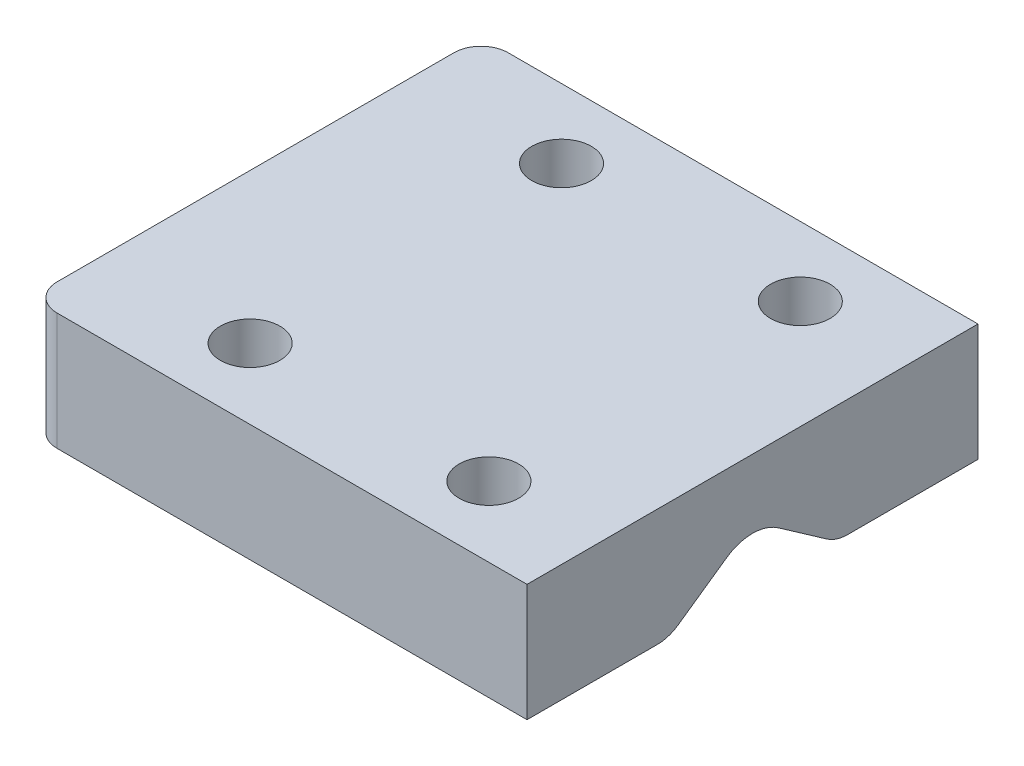
ISO-10303-21;
HEADER;
FILE_DESCRIPTION(('STEP AP214'),'2;1');
FILE_NAME('part.step','',(''),(''),'','','');
FILE_SCHEMA(('AUTOMOTIVE_DESIGN { 1 0 10303 214 1 1 1 1 }'));
ENDSEC;
DATA;
#1=APPLICATION_CONTEXT('core data for automotive mechanical design processes');
#2=APPLICATION_PROTOCOL_DEFINITION('international standard','automotive_design',2000,#1);
#3=PRODUCT_CONTEXT('',#1,'mechanical');
#4=PRODUCT('Part','Part','',(#3));
#5=PRODUCT_RELATED_PRODUCT_CATEGORY('part','',(#4));
#6=PRODUCT_DEFINITION_FORMATION('','',#4);
#7=PRODUCT_DEFINITION_CONTEXT('part definition',#1,'design');
#8=PRODUCT_DEFINITION('design','',#6,#7);
#9=PRODUCT_DEFINITION_SHAPE('','',#8);
#10=(LENGTH_UNIT() NAMED_UNIT(*) SI_UNIT(.MILLI.,.METRE.));
#11=(NAMED_UNIT(*) PLANE_ANGLE_UNIT() SI_UNIT($,.RADIAN.));
#12=(NAMED_UNIT(*) SI_UNIT($,.STERADIAN.) SOLID_ANGLE_UNIT());
#13=UNCERTAINTY_MEASURE_WITH_UNIT(LENGTH_MEASURE(1.E-05),#10,'distance_accuracy_value','');
#14=(GEOMETRIC_REPRESENTATION_CONTEXT(3) GLOBAL_UNCERTAINTY_ASSIGNED_CONTEXT((#13)) GLOBAL_UNIT_ASSIGNED_CONTEXT((#10,
#11,#12)) REPRESENTATION_CONTEXT('',''));
#15=CARTESIAN_POINT('',(0.,0.,0.));
#16=DIRECTION('',(0.,0.,1.));
#17=DIRECTION('',(1.,0.,0.));
#18=AXIS2_PLACEMENT_3D('',#15,#16,#17);
#19=CARTESIAN_POINT('',(0.,68.,0.));
#20=DIRECTION('',(0.,-1.,0.));
#21=DIRECTION('',(0.,0.,-1.));
#22=AXIS2_PLACEMENT_3D('',#19,#20,#21);
#23=PLANE('',#22);
#24=CARTESIAN_POINT('',(15.4737437034702,68.,-17.3243369322658));
#25=DIRECTION('',(0.,1.,0.));
#26=DIRECTION('',(0.,0.,1.));
#27=AXIS2_PLACEMENT_3D('',#24,#25,#26);
#28=CIRCLE('',#27,3.3);
#29=CARTESIAN_POINT('',(15.4737437034702,68.,-14.0243369322658));
#30=VERTEX_POINT('',#29);
#31=EDGE_CURVE('E287',#30,#30,#28,.T.);
#32=ORIENTED_EDGE('',*,*,#31,.T.);
#33=EDGE_LOOP('',(#32));
#34=FACE_BOUND('',#33,.T.);
#35=CARTESIAN_POINT('',(-11.,68.,-17.3243369322658));
#36=DIRECTION('',(0.,1.,0.));
#37=DIRECTION('',(0.,0.,1.));
#38=AXIS2_PLACEMENT_3D('',#35,#36,#37);
#39=CIRCLE('',#38,3.3);
#40=CARTESIAN_POINT('',(-11.,68.,-14.0243369322658));
#41=VERTEX_POINT('',#40);
#42=EDGE_CURVE('E288',#41,#41,#39,.T.);
#43=ORIENTED_EDGE('',*,*,#42,.T.);
#44=EDGE_LOOP('',(#43));
#45=FACE_BOUND('',#44,.T.);
#46=DIRECTION('',(0.,0.,-1.));
#47=VECTOR('',#46,1.);
#48=CARTESIAN_POINT('',(27.5,68.,-25.));
#49=LINE('',#48,#47);
#50=CARTESIAN_POINT('',(27.5,68.,-10.5441571993397));
#51=VERTEX_POINT('',#50);
#52=CARTESIAN_POINT('',(27.5,68.,-25.));
#53=VERTEX_POINT('',#52);
#54=EDGE_CURVE('E157',#51,#53,#49,.T.);
#55=ORIENTED_EDGE('',*,*,#54,.F.);
#56=DIRECTION('',(1.,0.,0.));
#57=VECTOR('',#56,1.);
#58=CARTESIAN_POINT('',(-27.5972353458108,68.,-10.5441571993397));
#59=LINE('',#58,#57);
#60=CARTESIAN_POINT('',(-27.5972353458108,68.,-10.5441571993397));
#61=VERTEX_POINT('',#60);
#62=EDGE_CURVE('E217',#51,#61,#59,.F.);
#63=ORIENTED_EDGE('',*,*,#62,.T.);
#64=DIRECTION('',(0.,0.,1.));
#65=VECTOR('',#64,1.);
#66=CARTESIAN_POINT('',(-27.5972353458108,68.,-25.));
#67=LINE('',#66,#65);
#68=CARTESIAN_POINT('',(-27.5972353458108,68.,-22.));
#69=VERTEX_POINT('',#68);
#70=EDGE_CURVE('E246',#69,#61,#67,.T.);
#71=ORIENTED_EDGE('',*,*,#70,.F.);
#72=CARTESIAN_POINT('',(-24.5972353458108,68.,-22.));
#73=DIRECTION('',(0.,-1.,0.));
#74=DIRECTION('',(0.,0.,-1.));
#75=AXIS2_PLACEMENT_3D('',#72,#73,#74);
#76=CIRCLE('',#75,3.);
#77=CARTESIAN_POINT('',(-24.5972353458108,68.,-25.));
#78=VERTEX_POINT('',#77);
#79=EDGE_CURVE('E187',#69,#78,#76,.T.);
#80=ORIENTED_EDGE('',*,*,#79,.T.);
#81=DIRECTION('',(-1.,0.,0.));
#82=VECTOR('',#81,1.);
#83=CARTESIAN_POINT('',(27.5,68.,-25.));
#84=LINE('',#83,#82);
#85=EDGE_CURVE('E237',#53,#78,#84,.T.);
#86=ORIENTED_EDGE('',*,*,#85,.F.);
#87=EDGE_LOOP('',(#55,#63,#71,#80,#86));
#88=FACE_BOUND('',#87,.T.);
#89=ADVANCED_FACE('F39',(#34,#45,#88),#23,.T.);
#90=CARTESIAN_POINT('',(27.5,81.,-25.));
#91=DIRECTION('',(-1.,0.,0.));
#92=DIRECTION('',(0.,0.,1.));
#93=AXIS2_PLACEMENT_3D('',#90,#91,#92);
#94=PLANE('',#93);
#95=DIRECTION('',(0.,0.573576436351044,0.819152044288993));
#96=VECTOR('',#95,1.);
#97=CARTESIAN_POINT('',(27.5,74.5,0.));
#98=LINE('',#97,#96);
#99=CARTESIAN_POINT('',(27.5,68.723391822844,-8.24985145393554));
#100=VERTEX_POINT('',#99);
#101=CARTESIAN_POINT('',(27.5,72.4918872776377,-2.86788218175522));
#102=VERTEX_POINT('',#101);
#103=EDGE_CURVE('E267',#100,#102,#98,.T.);
#104=ORIENTED_EDGE('',*,*,#103,.F.);
#105=CARTESIAN_POINT('',(27.5,72.,-10.5441571993397));
#106=DIRECTION('',(-1.,0.,0.));
#107=DIRECTION('',(0.,0.,1.));
#108=AXIS2_PLACEMENT_3D('',#105,#106,#107);
#109=CIRCLE('',#108,4.);
#110=EDGE_CURVE('E214',#100,#51,#109,.F.);
#111=ORIENTED_EDGE('',*,*,#110,.T.);
#112=ORIENTED_EDGE('',*,*,#54,.T.);
#113=DIRECTION('',(0.,-1.,0.));
#114=VECTOR('',#113,1.);
#115=CARTESIAN_POINT('',(27.5,81.,-25.));
#116=LINE('',#115,#114);
#117=CARTESIAN_POINT('',(27.5,81.,-25.));
#118=VERTEX_POINT('',#117);
#119=EDGE_CURVE('E134',#118,#53,#116,.T.);
#120=ORIENTED_EDGE('',*,*,#119,.F.);
#121=DIRECTION('',(0.,0.,-1.));
#122=VECTOR('',#121,1.);
#123=CARTESIAN_POINT('',(27.5,81.,-25.));
#124=LINE('',#123,#122);
#125=CARTESIAN_POINT('',(27.5,81.,25.));
#126=VERTEX_POINT('',#125);
#127=EDGE_CURVE('E141',#126,#118,#124,.T.);
#128=ORIENTED_EDGE('',*,*,#127,.F.);
#129=DIRECTION('',(0.,-1.,0.));
#130=VECTOR('',#129,1.);
#131=CARTESIAN_POINT('',(27.5,81.,25.));
#132=LINE('',#131,#130);
#133=CARTESIAN_POINT('',(27.5,68.,25.));
#134=VERTEX_POINT('',#133);
#135=EDGE_CURVE('E161',#126,#134,#132,.T.);
#136=ORIENTED_EDGE('',*,*,#135,.T.);
#137=CARTESIAN_POINT('',(27.5,68.,10.5441571993397));
#138=VERTEX_POINT('',#137);
#139=EDGE_CURVE('E232',#134,#138,#49,.T.);
#140=ORIENTED_EDGE('',*,*,#139,.T.);
#141=CARTESIAN_POINT('',(27.5,72.,10.5441571993397));
#142=DIRECTION('',(-1.,0.,0.));
#143=DIRECTION('',(0.,0.,1.));
#144=AXIS2_PLACEMENT_3D('',#141,#142,#143);
#145=CIRCLE('',#144,4.);
#146=CARTESIAN_POINT('',(27.5,68.723391822844,8.24985145393554));
#147=VERTEX_POINT('',#146);
#148=EDGE_CURVE('E211',#138,#147,#145,.F.);
#149=ORIENTED_EDGE('',*,*,#148,.T.);
#150=DIRECTION('',(0.,-0.573576436351044,0.819152044288993));
#151=VECTOR('',#150,1.);
#152=CARTESIAN_POINT('',(27.5,74.5,0.));
#153=LINE('',#152,#151);
#154=CARTESIAN_POINT('',(27.5,72.4918872776377,2.86788218175521));
#155=VERTEX_POINT('',#154);
#156=EDGE_CURVE('E263',#155,#147,#153,.T.);
#157=ORIENTED_EDGE('',*,*,#156,.F.);
#158=CARTESIAN_POINT('',(27.5,68.3961270561927,0.));
#159=DIRECTION('',(-1.,0.,0.));
#160=DIRECTION('',(0.,0.,1.));
#161=AXIS2_PLACEMENT_3D('',#158,#159,#160);
#162=CIRCLE('',#161,5.);
#163=EDGE_CURVE('E200',#155,#102,#162,.T.);
#164=ORIENTED_EDGE('',*,*,#163,.T.);
#165=EDGE_LOOP('',(#104,#111,#112,#120,#128,#136,#140,#149,#157,#164));
#166=FACE_BOUND('',#165,.T.);
#167=ADVANCED_FACE('F155',(#166),#94,.F.);
#168=CARTESIAN_POINT('',(27.5,81.,-25.));
#169=DIRECTION('',(0.,0.,1.));
#170=DIRECTION('',(1.,0.,0.));
#171=AXIS2_PLACEMENT_3D('',#168,#169,#170);
#172=PLANE('',#171);
#173=ORIENTED_EDGE('',*,*,#85,.T.);
#174=DIRECTION('',(0.,-1.,0.));
#175=VECTOR('',#174,1.);
#176=CARTESIAN_POINT('',(-24.5972353458108,81.,-25.));
#177=LINE('',#176,#175);
#178=CARTESIAN_POINT('',(-24.5972353458108,81.,-25.));
#179=VERTEX_POINT('',#178);
#180=EDGE_CURVE('E136',#78,#179,#177,.F.);
#181=ORIENTED_EDGE('',*,*,#180,.T.);
#182=DIRECTION('',(-1.,0.,0.));
#183=VECTOR('',#182,1.);
#184=CARTESIAN_POINT('',(27.5,81.,-25.));
#185=LINE('',#184,#183);
#186=EDGE_CURVE('E129',#118,#179,#185,.T.);
#187=ORIENTED_EDGE('',*,*,#186,.F.);
#188=ORIENTED_EDGE('',*,*,#119,.T.);
#189=EDGE_LOOP('',(#173,#181,#187,#188));
#190=FACE_BOUND('',#189,.T.);
#191=ADVANCED_FACE('F132',(#190),#172,.F.);
#192=CARTESIAN_POINT('',(-27.5972353458108,81.,-25.));
#193=DIRECTION('',(1.,0.,0.));
#194=DIRECTION('',(0.,0.,-1.));
#195=AXIS2_PLACEMENT_3D('',#192,#193,#194);
#196=PLANE('',#195);
#197=ORIENTED_EDGE('',*,*,#70,.T.);
#198=CARTESIAN_POINT('',(-27.5972353458108,72.,-10.5441571993397));
#199=DIRECTION('',(1.,0.,0.));
#200=DIRECTION('',(0.,0.,-1.));
#201=AXIS2_PLACEMENT_3D('',#198,#199,#200);
#202=CIRCLE('',#201,4.);
#203=CARTESIAN_POINT('',(-27.5972353458108,68.723391822844,-8.24985145393553));
#204=VERTEX_POINT('',#203);
#205=EDGE_CURVE('E222',#61,#204,#202,.F.);
#206=ORIENTED_EDGE('',*,*,#205,.T.);
#207=DIRECTION('',(0.,0.573576436351044,0.819152044288993));
#208=VECTOR('',#207,1.);
#209=CARTESIAN_POINT('',(-27.5972353458108,74.5,0.));
#210=LINE('',#209,#208);
#211=CARTESIAN_POINT('',(-27.5972353458108,72.4918872776377,-2.86788218175521));
#212=VERTEX_POINT('',#211);
#213=EDGE_CURVE('E266',#204,#212,#210,.T.);
#214=ORIENTED_EDGE('',*,*,#213,.T.);
#215=CARTESIAN_POINT('',(-27.5972353458108,68.3961270561927,0.));
#216=DIRECTION('',(1.,0.,0.));
#217=DIRECTION('',(0.,0.,-1.));
#218=AXIS2_PLACEMENT_3D('',#215,#216,#217);
#219=CIRCLE('',#218,5.);
#220=CARTESIAN_POINT('',(-27.5972353458108,72.4918872776377,2.86788218175522));
#221=VERTEX_POINT('',#220);
#222=EDGE_CURVE('E204',#212,#221,#219,.T.);
#223=ORIENTED_EDGE('',*,*,#222,.T.);
#224=DIRECTION('',(0.,-0.573576436351044,0.819152044288993));
#225=VECTOR('',#224,1.);
#226=CARTESIAN_POINT('',(-27.5972353458108,74.5,0.));
#227=LINE('',#226,#225);
#228=CARTESIAN_POINT('',(-27.5972353458108,68.723391822844,8.24985145393554));
#229=VERTEX_POINT('',#228);
#230=EDGE_CURVE('E242',#221,#229,#227,.T.);
#231=ORIENTED_EDGE('',*,*,#230,.T.);
#232=CARTESIAN_POINT('',(-27.5972353458108,72.,10.5441571993397));
#233=DIRECTION('',(1.,0.,0.));
#234=DIRECTION('',(0.,0.,-1.));
#235=AXIS2_PLACEMENT_3D('',#232,#233,#234);
#236=CIRCLE('',#235,4.);
#237=CARTESIAN_POINT('',(-27.5972353458108,68.,10.5441571993397));
#238=VERTEX_POINT('',#237);
#239=EDGE_CURVE('E60',#229,#238,#236,.F.);
#240=ORIENTED_EDGE('',*,*,#239,.T.);
#241=CARTESIAN_POINT('',(-27.5972353458108,68.,22.));
#242=VERTEX_POINT('',#241);
#243=EDGE_CURVE('E233',#238,#242,#67,.T.);
#244=ORIENTED_EDGE('',*,*,#243,.T.);
#245=DIRECTION('',(0.,-1.,0.));
#246=VECTOR('',#245,1.);
#247=CARTESIAN_POINT('',(-27.5972353458108,81.,22.));
#248=LINE('',#247,#246);
#249=CARTESIAN_POINT('',(-27.5972353458108,81.,22.));
#250=VERTEX_POINT('',#249);
#251=EDGE_CURVE('E178',#242,#250,#248,.F.);
#252=ORIENTED_EDGE('',*,*,#251,.T.);
#253=DIRECTION('',(0.,0.,1.));
#254=VECTOR('',#253,1.);
#255=CARTESIAN_POINT('',(-27.5972353458108,81.,-25.));
#256=LINE('',#255,#254);
#257=CARTESIAN_POINT('',(-27.5972353458108,81.,-22.));
#258=VERTEX_POINT('',#257);
#259=EDGE_CURVE('E140',#258,#250,#256,.T.);
#260=ORIENTED_EDGE('',*,*,#259,.F.);
#261=DIRECTION('',(0.,-1.,0.));
#262=VECTOR('',#261,1.);
#263=CARTESIAN_POINT('',(-27.5972353458108,81.,-22.));
#264=LINE('',#263,#262);
#265=EDGE_CURVE('E174',#258,#69,#264,.T.);
#266=ORIENTED_EDGE('',*,*,#265,.T.);
#267=EDGE_LOOP('',(#197,#206,#214,#223,#231,#240,#244,#252,#260,#266));
#268=FACE_BOUND('',#267,.T.);
#269=ADVANCED_FACE('F258',(#268),#196,.F.);
#270=CARTESIAN_POINT('',(27.5,81.,25.));
#271=DIRECTION('',(0.,0.,-1.));
#272=DIRECTION('',(-1.,0.,0.));
#273=AXIS2_PLACEMENT_3D('',#270,#271,#272);
#274=PLANE('',#273);
#275=DIRECTION('',(1.,0.,0.));
#276=VECTOR('',#275,1.);
#277=CARTESIAN_POINT('',(27.5,81.,25.));
#278=LINE('',#277,#276);
#279=CARTESIAN_POINT('',(-24.5972353458108,81.,25.));
#280=VERTEX_POINT('',#279);
#281=EDGE_CURVE('E147',#280,#126,#278,.T.);
#282=ORIENTED_EDGE('',*,*,#281,.F.);
#283=DIRECTION('',(0.,-1.,0.));
#284=VECTOR('',#283,1.);
#285=CARTESIAN_POINT('',(-24.5972353458108,81.,25.));
#286=LINE('',#285,#284);
#287=CARTESIAN_POINT('',(-24.5972353458108,68.,25.));
#288=VERTEX_POINT('',#287);
#289=EDGE_CURVE('E160',#280,#288,#286,.T.);
#290=ORIENTED_EDGE('',*,*,#289,.T.);
#291=DIRECTION('',(1.,0.,0.));
#292=VECTOR('',#291,1.);
#293=CARTESIAN_POINT('',(27.5,68.,25.));
#294=LINE('',#293,#292);
#295=EDGE_CURVE('E152',#288,#134,#294,.T.);
#296=ORIENTED_EDGE('',*,*,#295,.T.);
#297=ORIENTED_EDGE('',*,*,#135,.F.);
#298=EDGE_LOOP('',(#282,#290,#296,#297));
#299=FACE_BOUND('',#298,.T.);
#300=ADVANCED_FACE('F251',(#299),#274,.F.);
#301=CARTESIAN_POINT('',(0.,81.,0.));
#302=DIRECTION('',(0.,-1.,0.));
#303=DIRECTION('',(0.,0.,-1.));
#304=AXIS2_PLACEMENT_3D('',#301,#302,#303);
#305=PLANE('',#304);
#306=CARTESIAN_POINT('',(-11.,81.,17.201232434968));
#307=DIRECTION('',(0.,1.,0.));
#308=DIRECTION('',(0.,0.,1.));
#309=AXIS2_PLACEMENT_3D('',#306,#307,#308);
#310=CIRCLE('',#309,3.3);
#311=CARTESIAN_POINT('',(-11.,81.,20.501232434968));
#312=VERTEX_POINT('',#311);
#313=EDGE_CURVE('E292',#312,#312,#310,.T.);
#314=ORIENTED_EDGE('',*,*,#313,.F.);
#315=EDGE_LOOP('',(#314));
#316=FACE_BOUND('',#315,.T.);
#317=CARTESIAN_POINT('',(15.4737437034702,81.,-17.3243369322658));
#318=DIRECTION('',(0.,1.,0.));
#319=DIRECTION('',(0.,0.,1.));
#320=AXIS2_PLACEMENT_3D('',#317,#318,#319);
#321=CIRCLE('',#320,3.3);
#322=CARTESIAN_POINT('',(15.4737437034702,81.,-14.0243369322658));
#323=VERTEX_POINT('',#322);
#324=EDGE_CURVE('E283',#323,#323,#321,.T.);
#325=ORIENTED_EDGE('',*,*,#324,.F.);
#326=EDGE_LOOP('',(#325));
#327=FACE_BOUND('',#326,.T.);
#328=CARTESIAN_POINT('',(-11.,81.,-17.3243369322658));
#329=DIRECTION('',(0.,1.,0.));
#330=DIRECTION('',(0.,0.,1.));
#331=AXIS2_PLACEMENT_3D('',#328,#329,#330);
#332=CIRCLE('',#331,3.3);
#333=CARTESIAN_POINT('',(-11.,81.,-14.0243369322658));
#334=VERTEX_POINT('',#333);
#335=EDGE_CURVE('E299',#334,#334,#332,.T.);
#336=ORIENTED_EDGE('',*,*,#335,.F.);
#337=EDGE_LOOP('',(#336));
#338=FACE_BOUND('',#337,.T.);
#339=CARTESIAN_POINT('',(15.4737437034702,81.,17.2012324349681));
#340=DIRECTION('',(0.,1.,0.));
#341=DIRECTION('',(0.,0.,1.));
#342=AXIS2_PLACEMENT_3D('',#339,#340,#341);
#343=CIRCLE('',#342,3.3);
#344=CARTESIAN_POINT('',(15.4737437034702,81.,20.5012324349681));
#345=VERTEX_POINT('',#344);
#346=EDGE_CURVE('E275',#345,#345,#343,.T.);
#347=ORIENTED_EDGE('',*,*,#346,.F.);
#348=EDGE_LOOP('',(#347));
#349=FACE_BOUND('',#348,.T.);
#350=ORIENTED_EDGE('',*,*,#259,.T.);
#351=CARTESIAN_POINT('',(-24.5972353458108,81.,22.));
#352=DIRECTION('',(0.,-1.,0.));
#353=DIRECTION('',(0.,0.,-1.));
#354=AXIS2_PLACEMENT_3D('',#351,#352,#353);
#355=CIRCLE('',#354,3.);
#356=EDGE_CURVE('E184',#250,#280,#355,.F.);
#357=ORIENTED_EDGE('',*,*,#356,.T.);
#358=ORIENTED_EDGE('',*,*,#281,.T.);
#359=ORIENTED_EDGE('',*,*,#127,.T.);
#360=ORIENTED_EDGE('',*,*,#186,.T.);
#361=CARTESIAN_POINT('',(-24.5972353458108,81.,-22.));
#362=DIRECTION('',(0.,-1.,0.));
#363=DIRECTION('',(0.,0.,-1.));
#364=AXIS2_PLACEMENT_3D('',#361,#362,#363);
#365=CIRCLE('',#364,3.);
#366=EDGE_CURVE('E181',#179,#258,#365,.F.);
#367=ORIENTED_EDGE('',*,*,#366,.T.);
#368=EDGE_LOOP('',(#350,#357,#358,#359,#360,#367));
#369=FACE_BOUND('',#368,.T.);
#370=ADVANCED_FACE('F145',(#316,#327,#338,#349,#369),#305,.F.);
#371=CARTESIAN_POINT('',(-11.,68.,17.201232434968));
#372=DIRECTION('',(0.,1.,0.));
#373=DIRECTION('',(0.,0.,1.));
#374=AXIS2_PLACEMENT_3D('',#371,#372,#373);
#375=CIRCLE('',#374,3.3);
#376=CARTESIAN_POINT('',(-11.,68.,20.501232434968));
#377=VERTEX_POINT('',#376);
#378=EDGE_CURVE('E279',#377,#377,#375,.T.);
#379=ORIENTED_EDGE('',*,*,#378,.T.);
#380=EDGE_LOOP('',(#379));
#381=FACE_BOUND('',#380,.T.);
#382=CARTESIAN_POINT('',(15.4737437034702,68.,17.2012324349681));
#383=DIRECTION('',(0.,1.,0.));
#384=DIRECTION('',(0.,0.,1.));
#385=AXIS2_PLACEMENT_3D('',#382,#383,#384);
#386=CIRCLE('',#385,3.3);
#387=CARTESIAN_POINT('',(15.4737437034702,68.,20.5012324349681));
#388=VERTEX_POINT('',#387);
#389=EDGE_CURVE('E270',#388,#388,#386,.T.);
#390=ORIENTED_EDGE('',*,*,#389,.T.);
#391=EDGE_LOOP('',(#390));
#392=FACE_BOUND('',#391,.T.);
#393=ORIENTED_EDGE('',*,*,#243,.F.);
#394=DIRECTION('',(1.,0.,0.));
#395=VECTOR('',#394,1.);
#396=CARTESIAN_POINT('',(27.5,68.,10.5441571993397));
#397=LINE('',#396,#395);
#398=EDGE_CURVE('E48',#238,#138,#397,.T.);
#399=ORIENTED_EDGE('',*,*,#398,.T.);
#400=ORIENTED_EDGE('',*,*,#139,.F.);
#401=ORIENTED_EDGE('',*,*,#295,.F.);
#402=CARTESIAN_POINT('',(-24.5972353458108,68.,22.));
#403=DIRECTION('',(0.,-1.,0.));
#404=DIRECTION('',(0.,0.,-1.));
#405=AXIS2_PLACEMENT_3D('',#402,#403,#404);
#406=CIRCLE('',#405,3.);
#407=EDGE_CURVE('E166',#288,#242,#406,.T.);
#408=ORIENTED_EDGE('',*,*,#407,.T.);
#409=EDGE_LOOP('',(#393,#399,#400,#401,#408));
#410=FACE_BOUND('',#409,.T.);
#411=ADVANCED_FACE('F230',(#381,#392,#410),#23,.T.);
#412=CARTESIAN_POINT('',(-27.5972353458108,74.5,0.));
#413=DIRECTION('',(0.,0.819152044288993,-0.573576436351044));
#414=DIRECTION('',(0.,0.573576436351044,0.819152044288993));
#415=AXIS2_PLACEMENT_3D('',#412,#413,#414);
#416=PLANE('',#415);
#417=ORIENTED_EDGE('',*,*,#213,.F.);
#418=DIRECTION('',(1.,0.,0.));
#419=VECTOR('',#418,1.);
#420=CARTESIAN_POINT('',(27.5,68.723391822844,-8.24985145393554));
#421=LINE('',#420,#419);
#422=EDGE_CURVE('E207',#204,#100,#421,.T.);
#423=ORIENTED_EDGE('',*,*,#422,.T.);
#424=ORIENTED_EDGE('',*,*,#103,.T.);
#425=DIRECTION('',(1.,0.,0.));
#426=VECTOR('',#425,1.);
#427=CARTESIAN_POINT('',(-27.5972353458108,72.4918872776377,-2.86788218175521));
#428=LINE('',#427,#426);
#429=EDGE_CURVE('E196',#102,#212,#428,.F.);
#430=ORIENTED_EDGE('',*,*,#429,.T.);
#431=EDGE_LOOP('',(#417,#423,#424,#430));
#432=FACE_BOUND('',#431,.T.);
#433=ADVANCED_FACE('F349',(#432),#416,.F.);
#434=CARTESIAN_POINT('',(-27.5972353458108,74.5,0.));
#435=DIRECTION('',(0.,0.819152044288993,0.573576436351044));
#436=DIRECTION('',(0.,-0.573576436351044,0.819152044288993));
#437=AXIS2_PLACEMENT_3D('',#434,#435,#436);
#438=PLANE('',#437);
#439=ORIENTED_EDGE('',*,*,#156,.T.);
#440=DIRECTION('',(1.,0.,0.));
#441=VECTOR('',#440,1.);
#442=CARTESIAN_POINT('',(-27.5972353458108,68.723391822844,8.24985145393554));
#443=LINE('',#442,#441);
#444=EDGE_CURVE('E11',#147,#229,#443,.F.);
#445=ORIENTED_EDGE('',*,*,#444,.T.);
#446=ORIENTED_EDGE('',*,*,#230,.F.);
#447=DIRECTION('',(1.,0.,0.));
#448=VECTOR('',#447,1.);
#449=CARTESIAN_POINT('',(27.5,72.4918872776377,2.86788218175522));
#450=LINE('',#449,#448);
#451=EDGE_CURVE('E192',#221,#155,#450,.T.);
#452=ORIENTED_EDGE('',*,*,#451,.T.);
#453=EDGE_LOOP('',(#439,#445,#446,#452));
#454=FACE_BOUND('',#453,.T.);
#455=ADVANCED_FACE('F355',(#454),#438,.F.);
#456=CARTESIAN_POINT('',(-24.5972353458108,81.,22.));
#457=DIRECTION('',(0.,-1.,0.));
#458=DIRECTION('',(0.,0.,-1.));
#459=AXIS2_PLACEMENT_3D('',#456,#457,#458);
#460=CYLINDRICAL_SURFACE('',#459,3.);
#461=ORIENTED_EDGE('',*,*,#356,.F.);
#462=ORIENTED_EDGE('',*,*,#251,.F.);
#463=ORIENTED_EDGE('',*,*,#407,.F.);
#464=ORIENTED_EDGE('',*,*,#289,.F.);
#465=EDGE_LOOP('',(#461,#462,#463,#464));
#466=FACE_BOUND('',#465,.T.);
#467=ADVANCED_FACE('F256',(#466),#460,.T.);
#468=CARTESIAN_POINT('',(-24.5972353458108,81.,-22.));
#469=DIRECTION('',(0.,-1.,0.));
#470=DIRECTION('',(0.,0.,-1.));
#471=AXIS2_PLACEMENT_3D('',#468,#469,#470);
#472=CYLINDRICAL_SURFACE('',#471,3.);
#473=ORIENTED_EDGE('',*,*,#366,.F.);
#474=ORIENTED_EDGE('',*,*,#180,.F.);
#475=ORIENTED_EDGE('',*,*,#79,.F.);
#476=ORIENTED_EDGE('',*,*,#265,.F.);
#477=EDGE_LOOP('',(#473,#474,#475,#476));
#478=FACE_BOUND('',#477,.T.);
#479=ADVANCED_FACE('F325',(#478),#472,.T.);
#480=CARTESIAN_POINT('',(15.4737437034702,68.,17.2012324349681));
#481=DIRECTION('',(0.,1.,0.));
#482=DIRECTION('',(0.,0.,1.));
#483=AXIS2_PLACEMENT_3D('',#480,#481,#482);
#484=CYLINDRICAL_SURFACE('',#483,3.3);
#485=ORIENTED_EDGE('',*,*,#389,.F.);
#486=EDGE_LOOP('',(#485));
#487=FACE_BOUND('',#486,.T.);
#488=ORIENTED_EDGE('',*,*,#346,.T.);
#489=EDGE_LOOP('',(#488));
#490=FACE_BOUND('',#489,.T.);
#491=ADVANCED_FACE('F323',(#487,#490),#484,.F.);
#492=CARTESIAN_POINT('',(-11.,68.,17.201232434968));
#493=DIRECTION('',(0.,1.,0.));
#494=DIRECTION('',(0.,0.,1.));
#495=AXIS2_PLACEMENT_3D('',#492,#493,#494);
#496=CYLINDRICAL_SURFACE('',#495,3.3);
#497=ORIENTED_EDGE('',*,*,#378,.F.);
#498=EDGE_LOOP('',(#497));
#499=FACE_BOUND('',#498,.T.);
#500=ORIENTED_EDGE('',*,*,#313,.T.);
#501=EDGE_LOOP('',(#500));
#502=FACE_BOUND('',#501,.T.);
#503=ADVANCED_FACE('F313',(#499,#502),#496,.F.);
#504=CARTESIAN_POINT('',(-11.,68.,-17.3243369322658));
#505=DIRECTION('',(0.,1.,0.));
#506=DIRECTION('',(0.,0.,1.));
#507=AXIS2_PLACEMENT_3D('',#504,#505,#506);
#508=CYLINDRICAL_SURFACE('',#507,3.3);
#509=ORIENTED_EDGE('',*,*,#42,.F.);
#510=EDGE_LOOP('',(#509));
#511=FACE_BOUND('',#510,.T.);
#512=ORIENTED_EDGE('',*,*,#335,.T.);
#513=EDGE_LOOP('',(#512));
#514=FACE_BOUND('',#513,.T.);
#515=ADVANCED_FACE('F309',(#511,#514),#508,.F.);
#516=CARTESIAN_POINT('',(15.4737437034702,68.,-17.3243369322658));
#517=DIRECTION('',(0.,1.,0.));
#518=DIRECTION('',(0.,0.,1.));
#519=AXIS2_PLACEMENT_3D('',#516,#517,#518);
#520=CYLINDRICAL_SURFACE('',#519,3.3);
#521=ORIENTED_EDGE('',*,*,#31,.F.);
#522=EDGE_LOOP('',(#521));
#523=FACE_BOUND('',#522,.T.);
#524=ORIENTED_EDGE('',*,*,#324,.T.);
#525=EDGE_LOOP('',(#524));
#526=FACE_BOUND('',#525,.T.);
#527=ADVANCED_FACE('F312',(#523,#526),#520,.F.);
#528=CARTESIAN_POINT('',(-27.5972353458108,68.3961270561927,0.));
#529=DIRECTION('',(-1.,0.,0.));
#530=DIRECTION('',(0.,0.,1.));
#531=AXIS2_PLACEMENT_3D('',#528,#529,#530);
#532=CYLINDRICAL_SURFACE('',#531,5.);
#533=ORIENTED_EDGE('',*,*,#222,.F.);
#534=ORIENTED_EDGE('',*,*,#429,.F.);
#535=ORIENTED_EDGE('',*,*,#163,.F.);
#536=ORIENTED_EDGE('',*,*,#451,.F.);
#537=EDGE_LOOP('',(#533,#534,#535,#536));
#538=FACE_BOUND('',#537,.T.);
#539=ADVANCED_FACE('F366',(#538),#532,.F.);
#540=CARTESIAN_POINT('',(-27.5972353458108,72.,-10.5441571993397));
#541=DIRECTION('',(-1.,0.,0.));
#542=DIRECTION('',(0.,0.,1.));
#543=AXIS2_PLACEMENT_3D('',#540,#541,#542);
#544=CYLINDRICAL_SURFACE('',#543,4.);
#545=ORIENTED_EDGE('',*,*,#205,.F.);
#546=ORIENTED_EDGE('',*,*,#62,.F.);
#547=ORIENTED_EDGE('',*,*,#110,.F.);
#548=ORIENTED_EDGE('',*,*,#422,.F.);
#549=EDGE_LOOP('',(#545,#546,#547,#548));
#550=FACE_BOUND('',#549,.T.);
#551=ADVANCED_FACE('F371',(#550),#544,.T.);
#552=CARTESIAN_POINT('',(0.,72.,10.5441571993397));
#553=DIRECTION('',(-1.,0.,0.));
#554=DIRECTION('',(0.,0.,1.));
#555=AXIS2_PLACEMENT_3D('',#552,#553,#554);
#556=CYLINDRICAL_SURFACE('',#555,4.);
#557=ORIENTED_EDGE('',*,*,#239,.F.);
#558=ORIENTED_EDGE('',*,*,#444,.F.);
#559=ORIENTED_EDGE('',*,*,#148,.F.);
#560=ORIENTED_EDGE('',*,*,#398,.F.);
#561=EDGE_LOOP('',(#557,#558,#559,#560));
#562=FACE_BOUND('',#561,.T.);
#563=ADVANCED_FACE('F41',(#562),#556,.T.);
#564=CLOSED_SHELL('',(#89,#167,#191,#269,#300,#370,#411,#433,#455,#467,#479,#491,#503,#515,#527,
#539,#551,#563));
#565=MANIFOLD_SOLID_BREP('B2',#564);
#566=ADVANCED_BREP_SHAPE_REPRESENTATION('',(#18,#565),#14);
#567=SHAPE_DEFINITION_REPRESENTATION(#9,#566);
ENDSEC;
END-ISO-10303-21;
